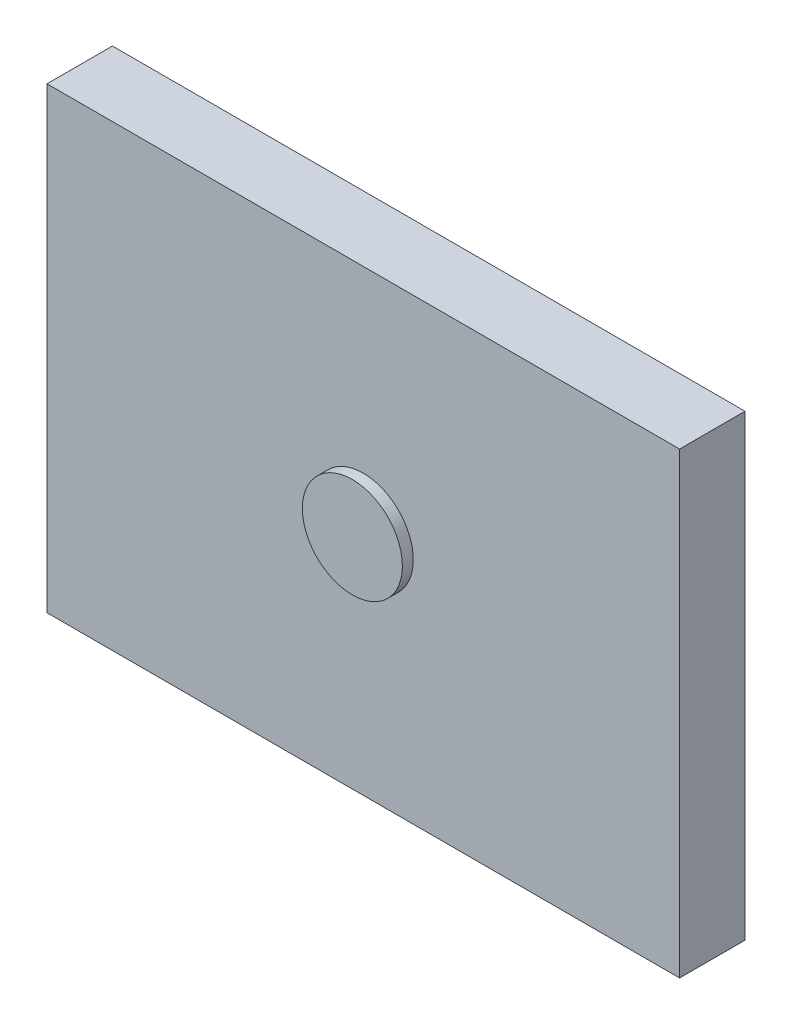
ISO-10303-21;
HEADER;
FILE_DESCRIPTION(('STEP AP214'),'2;1');
FILE_NAME('part.step','',(''),(''),'','','');
FILE_SCHEMA(('AUTOMOTIVE_DESIGN { 1 0 10303 214 1 1 1 1 }'));
ENDSEC;
DATA;
#1=APPLICATION_CONTEXT('core data for automotive mechanical design processes');
#2=APPLICATION_PROTOCOL_DEFINITION('international standard','automotive_design',2000,#1);
#3=PRODUCT_CONTEXT('',#1,'mechanical');
#4=PRODUCT('Part','Part','',(#3));
#5=PRODUCT_RELATED_PRODUCT_CATEGORY('part','',(#4));
#6=PRODUCT_DEFINITION_FORMATION('','',#4);
#7=PRODUCT_DEFINITION_CONTEXT('part definition',#1,'design');
#8=PRODUCT_DEFINITION('design','',#6,#7);
#9=PRODUCT_DEFINITION_SHAPE('','',#8);
#10=(LENGTH_UNIT() NAMED_UNIT(*) SI_UNIT(.MILLI.,.METRE.));
#11=(NAMED_UNIT(*) PLANE_ANGLE_UNIT() SI_UNIT($,.RADIAN.));
#12=(NAMED_UNIT(*) SI_UNIT($,.STERADIAN.) SOLID_ANGLE_UNIT());
#13=UNCERTAINTY_MEASURE_WITH_UNIT(LENGTH_MEASURE(1.E-05),#10,'distance_accuracy_value','');
#14=(GEOMETRIC_REPRESENTATION_CONTEXT(3) GLOBAL_UNCERTAINTY_ASSIGNED_CONTEXT((#13)) GLOBAL_UNIT_ASSIGNED_CONTEXT((#10,
#11,#12)) REPRESENTATION_CONTEXT('',''));
#15=CARTESIAN_POINT('',(0.,0.,0.));
#16=DIRECTION('',(0.,0.,1.));
#17=DIRECTION('',(1.,0.,0.));
#18=AXIS2_PLACEMENT_3D('',#15,#16,#17);
#19=CARTESIAN_POINT('',(145.,-105.,30.));
#20=DIRECTION('',(-1.,0.,0.));
#21=DIRECTION('',(0.,0.,1.));
#22=AXIS2_PLACEMENT_3D('',#19,#20,#21);
#23=PLANE('',#22);
#24=DIRECTION('',(0.,1.,0.));
#25=VECTOR('',#24,1.);
#26=CARTESIAN_POINT('',(145.,-105.,0.));
#27=LINE('',#26,#25);
#28=CARTESIAN_POINT('',(145.,-105.,0.));
#29=VERTEX_POINT('',#28);
#30=CARTESIAN_POINT('',(145.,105.,0.));
#31=VERTEX_POINT('',#30);
#32=EDGE_CURVE('E101',#29,#31,#27,.T.);
#33=ORIENTED_EDGE('',*,*,#32,.T.);
#34=DIRECTION('',(0.,0.,-1.));
#35=VECTOR('',#34,1.);
#36=CARTESIAN_POINT('',(145.,105.,30.));
#37=LINE('',#36,#35);
#38=CARTESIAN_POINT('',(145.,105.,30.));
#39=VERTEX_POINT('',#38);
#40=EDGE_CURVE('E43',#39,#31,#37,.T.);
#41=ORIENTED_EDGE('',*,*,#40,.F.);
#42=DIRECTION('',(0.,1.,0.));
#43=VECTOR('',#42,1.);
#44=CARTESIAN_POINT('',(145.,-105.,30.));
#45=LINE('',#44,#43);
#46=CARTESIAN_POINT('',(145.,-105.,30.));
#47=VERTEX_POINT('',#46);
#48=EDGE_CURVE('E87',#47,#39,#45,.T.);
#49=ORIENTED_EDGE('',*,*,#48,.F.);
#50=DIRECTION('',(0.,0.,-1.));
#51=VECTOR('',#50,1.);
#52=CARTESIAN_POINT('',(145.,-105.,30.));
#53=LINE('',#52,#51);
#54=EDGE_CURVE('E97',#47,#29,#53,.T.);
#55=ORIENTED_EDGE('',*,*,#54,.T.);
#56=EDGE_LOOP('',(#33,#41,#49,#55));
#57=FACE_BOUND('',#56,.T.);
#58=ADVANCED_FACE('F35',(#57),#23,.F.);
#59=CARTESIAN_POINT('',(-145.,105.,30.));
#60=DIRECTION('',(0.,-1.,0.));
#61=DIRECTION('',(0.,0.,-1.));
#62=AXIS2_PLACEMENT_3D('',#59,#60,#61);
#63=PLANE('',#62);
#64=DIRECTION('',(-1.,0.,0.));
#65=VECTOR('',#64,1.);
#66=CARTESIAN_POINT('',(-145.,105.,0.));
#67=LINE('',#66,#65);
#68=CARTESIAN_POINT('',(-145.,105.,0.));
#69=VERTEX_POINT('',#68);
#70=EDGE_CURVE('E92',#31,#69,#67,.T.);
#71=ORIENTED_EDGE('',*,*,#70,.T.);
#72=DIRECTION('',(0.,0.,-1.));
#73=VECTOR('',#72,1.);
#74=CARTESIAN_POINT('',(-145.,105.,30.));
#75=LINE('',#74,#73);
#76=CARTESIAN_POINT('',(-145.,105.,30.));
#77=VERTEX_POINT('',#76);
#78=EDGE_CURVE('E90',#77,#69,#75,.T.);
#79=ORIENTED_EDGE('',*,*,#78,.F.);
#80=DIRECTION('',(-1.,0.,0.));
#81=VECTOR('',#80,1.);
#82=CARTESIAN_POINT('',(-145.,105.,30.));
#83=LINE('',#82,#81);
#84=EDGE_CURVE('E82',#39,#77,#83,.T.);
#85=ORIENTED_EDGE('',*,*,#84,.F.);
#86=ORIENTED_EDGE('',*,*,#40,.T.);
#87=EDGE_LOOP('',(#71,#79,#85,#86));
#88=FACE_BOUND('',#87,.T.);
#89=ADVANCED_FACE('F91',(#88),#63,.F.);
#90=CARTESIAN_POINT('',(-145.,-105.,30.));
#91=DIRECTION('',(1.,0.,0.));
#92=DIRECTION('',(0.,0.,-1.));
#93=AXIS2_PLACEMENT_3D('',#90,#91,#92);
#94=PLANE('',#93);
#95=DIRECTION('',(0.,-1.,0.));
#96=VECTOR('',#95,1.);
#97=CARTESIAN_POINT('',(-145.,-105.,0.));
#98=LINE('',#97,#96);
#99=CARTESIAN_POINT('',(-145.,-105.,0.));
#100=VERTEX_POINT('',#99);
#101=EDGE_CURVE('E68',#69,#100,#98,.T.);
#102=ORIENTED_EDGE('',*,*,#101,.T.);
#103=DIRECTION('',(0.,0.,-1.));
#104=VECTOR('',#103,1.);
#105=CARTESIAN_POINT('',(-145.,-105.,30.));
#106=LINE('',#105,#104);
#107=CARTESIAN_POINT('',(-145.,-105.,30.));
#108=VERTEX_POINT('',#107);
#109=EDGE_CURVE('E93',#108,#100,#106,.T.);
#110=ORIENTED_EDGE('',*,*,#109,.F.);
#111=DIRECTION('',(0.,-1.,0.));
#112=VECTOR('',#111,1.);
#113=CARTESIAN_POINT('',(-145.,-105.,30.));
#114=LINE('',#113,#112);
#115=EDGE_CURVE('E85',#77,#108,#114,.T.);
#116=ORIENTED_EDGE('',*,*,#115,.F.);
#117=ORIENTED_EDGE('',*,*,#78,.T.);
#118=EDGE_LOOP('',(#102,#110,#116,#117));
#119=FACE_BOUND('',#118,.T.);
#120=ADVANCED_FACE('F95',(#119),#94,.F.);
#121=CARTESIAN_POINT('',(-145.,-105.,30.));
#122=DIRECTION('',(0.,1.,0.));
#123=DIRECTION('',(0.,0.,1.));
#124=AXIS2_PLACEMENT_3D('',#121,#122,#123);
#125=PLANE('',#124);
#126=DIRECTION('',(1.,0.,0.));
#127=VECTOR('',#126,1.);
#128=CARTESIAN_POINT('',(-145.,-105.,0.));
#129=LINE('',#128,#127);
#130=EDGE_CURVE('E74',#100,#29,#129,.T.);
#131=ORIENTED_EDGE('',*,*,#130,.T.);
#132=ORIENTED_EDGE('',*,*,#54,.F.);
#133=DIRECTION('',(1.,0.,0.));
#134=VECTOR('',#133,1.);
#135=CARTESIAN_POINT('',(-145.,-105.,30.));
#136=LINE('',#135,#134);
#137=EDGE_CURVE('E51',#108,#47,#136,.T.);
#138=ORIENTED_EDGE('',*,*,#137,.F.);
#139=ORIENTED_EDGE('',*,*,#109,.T.);
#140=EDGE_LOOP('',(#131,#132,#138,#139));
#141=FACE_BOUND('',#140,.T.);
#142=ADVANCED_FACE('F123',(#141),#125,.F.);
#143=CARTESIAN_POINT('',(0.,0.,30.));
#144=DIRECTION('',(0.,0.,-1.));
#145=DIRECTION('',(-1.,0.,0.));
#146=AXIS2_PLACEMENT_3D('',#143,#144,#145);
#147=PLANE('',#146);
#148=CARTESIAN_POINT('',(0.,0.,30.));
#149=DIRECTION('',(0.,0.,-1.));
#150=DIRECTION('',(-1.,0.,0.));
#151=AXIS2_PLACEMENT_3D('',#148,#149,#150);
#152=CIRCLE('',#151,22.9203241784198);
#153=CARTESIAN_POINT('',(-22.9203241784198,0.,30.));
#154=VERTEX_POINT('',#153);
#155=EDGE_CURVE('E11',#154,#154,#152,.F.);
#156=ORIENTED_EDGE('',*,*,#155,.F.);
#157=EDGE_LOOP('',(#156));
#158=FACE_BOUND('',#157,.T.);
#159=ORIENTED_EDGE('',*,*,#48,.T.);
#160=ORIENTED_EDGE('',*,*,#84,.T.);
#161=ORIENTED_EDGE('',*,*,#115,.T.);
#162=ORIENTED_EDGE('',*,*,#137,.T.);
#163=EDGE_LOOP('',(#159,#160,#161,#162));
#164=FACE_BOUND('',#163,.T.);
#165=ADVANCED_FACE('F83',(#158,#164),#147,.F.);
#166=CARTESIAN_POINT('',(0.,0.,0.));
#167=DIRECTION('',(0.,0.,-1.));
#168=DIRECTION('',(-1.,0.,0.));
#169=AXIS2_PLACEMENT_3D('',#166,#167,#168);
#170=PLANE('',#169);
#171=ORIENTED_EDGE('',*,*,#32,.F.);
#172=ORIENTED_EDGE('',*,*,#130,.F.);
#173=ORIENTED_EDGE('',*,*,#101,.F.);
#174=ORIENTED_EDGE('',*,*,#70,.F.);
#175=EDGE_LOOP('',(#171,#172,#173,#174));
#176=FACE_BOUND('',#175,.T.);
#177=ADVANCED_FACE('F112',(#176),#170,.T.);
#178=CARTESIAN_POINT('',(0.,0.,35.));
#179=DIRECTION('',(0.,0.,-1.));
#180=DIRECTION('',(-1.,0.,0.));
#181=AXIS2_PLACEMENT_3D('',#178,#179,#180);
#182=CYLINDRICAL_SURFACE('',#181,22.9203241784198);
#183=CARTESIAN_POINT('',(0.,0.,35.));
#184=DIRECTION('',(0.,0.,1.));
#185=DIRECTION('',(1.,0.,0.));
#186=AXIS2_PLACEMENT_3D('',#183,#184,#185);
#187=CIRCLE('',#186,22.9203241784198);
#188=CARTESIAN_POINT('',(22.9203241784198,0.,35.));
#189=VERTEX_POINT('',#188);
#190=EDGE_CURVE('E104',#189,#189,#187,.T.);
#191=ORIENTED_EDGE('',*,*,#190,.F.);
#192=EDGE_LOOP('',(#191));
#193=FACE_BOUND('',#192,.T.);
#194=ORIENTED_EDGE('',*,*,#155,.T.);
#195=EDGE_LOOP('',(#194));
#196=FACE_BOUND('',#195,.T.);
#197=ADVANCED_FACE('F114',(#193,#196),#182,.T.);
#198=CARTESIAN_POINT('',(0.,0.,35.));
#199=DIRECTION('',(0.,0.,1.));
#200=DIRECTION('',(1.,0.,0.));
#201=AXIS2_PLACEMENT_3D('',#198,#199,#200);
#202=PLANE('',#201);
#203=ORIENTED_EDGE('',*,*,#190,.T.);
#204=EDGE_LOOP('',(#203));
#205=FACE_BOUND('',#204,.T.);
#206=ADVANCED_FACE('F120',(#205),#202,.T.);
#207=CLOSED_SHELL('',(#58,#89,#120,#142,#165,#177,#197,#206));
#208=MANIFOLD_SOLID_BREP('B2',#207);
#209=ADVANCED_BREP_SHAPE_REPRESENTATION('',(#18,#208),#14);
#210=SHAPE_DEFINITION_REPRESENTATION(#9,#209);
ENDSEC;
END-ISO-10303-21;
